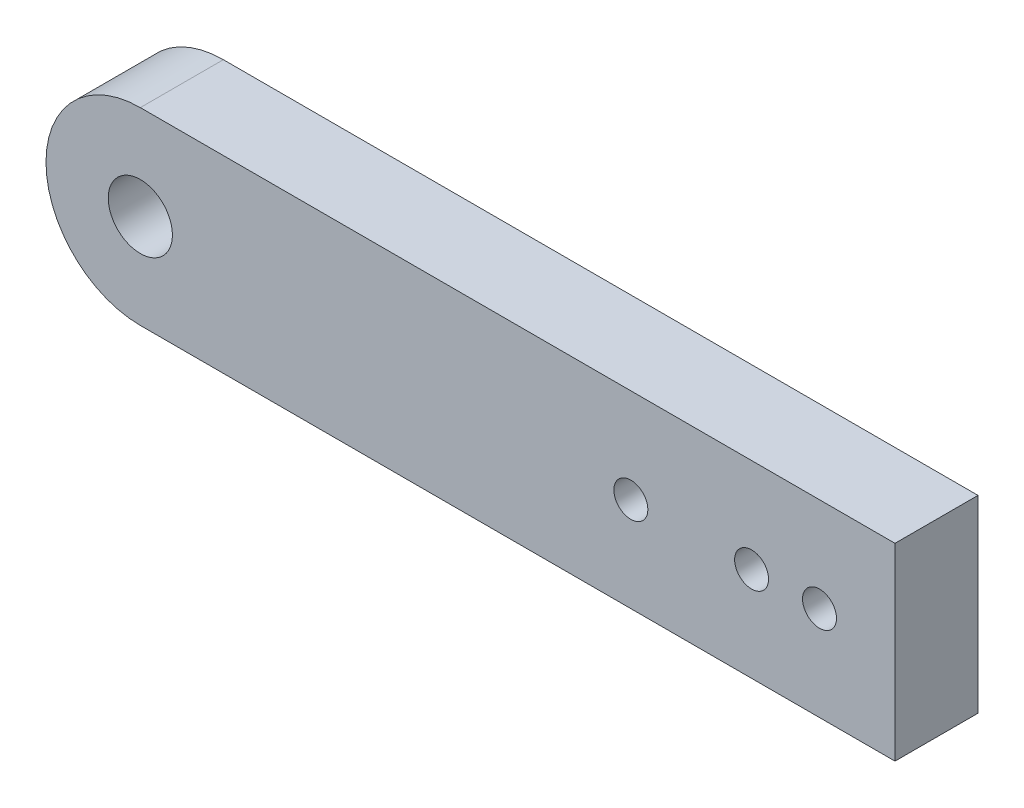
ISO-10303-21;
HEADER;
FILE_DESCRIPTION(('STEP AP214'),'2;1');
FILE_NAME('part.step','',(''),(''),'','','');
FILE_SCHEMA(('AUTOMOTIVE_DESIGN { 1 0 10303 214 1 1 1 1 }'));
ENDSEC;
DATA;
#1=APPLICATION_CONTEXT('core data for automotive mechanical design processes');
#2=APPLICATION_PROTOCOL_DEFINITION('international standard','automotive_design',2000,#1);
#3=PRODUCT_CONTEXT('',#1,'mechanical');
#4=PRODUCT('Part','Part','',(#3));
#5=PRODUCT_RELATED_PRODUCT_CATEGORY('part','',(#4));
#6=PRODUCT_DEFINITION_FORMATION('','',#4);
#7=PRODUCT_DEFINITION_CONTEXT('part definition',#1,'design');
#8=PRODUCT_DEFINITION('design','',#6,#7);
#9=PRODUCT_DEFINITION_SHAPE('','',#8);
#10=(LENGTH_UNIT() NAMED_UNIT(*) SI_UNIT(.MILLI.,.METRE.));
#11=(NAMED_UNIT(*) PLANE_ANGLE_UNIT() SI_UNIT($,.RADIAN.));
#12=(NAMED_UNIT(*) SI_UNIT($,.STERADIAN.) SOLID_ANGLE_UNIT());
#13=UNCERTAINTY_MEASURE_WITH_UNIT(LENGTH_MEASURE(1.E-05),#10,'distance_accuracy_value','');
#14=(GEOMETRIC_REPRESENTATION_CONTEXT(3) GLOBAL_UNCERTAINTY_ASSIGNED_CONTEXT((#13)) GLOBAL_UNIT_ASSIGNED_CONTEXT((#10,
#11,#12)) REPRESENTATION_CONTEXT('',''));
#15=CARTESIAN_POINT('',(0.,0.,0.));
#16=DIRECTION('',(0.,0.,1.));
#17=DIRECTION('',(1.,0.,0.));
#18=AXIS2_PLACEMENT_3D('',#15,#16,#17);
#19=CARTESIAN_POINT('',(-56.8282608698775,-2.53872853885262,11.));
#20=DIRECTION('',(0.,0.,1.));
#21=DIRECTION('',(1.,0.,0.));
#22=AXIS2_PLACEMENT_3D('',#19,#20,#21);
#23=PLANE('',#22);
#24=CARTESIAN_POINT('',(8.17173913012246,-2.53872853885262,11.));
#25=DIRECTION('',(0.,0.,1.));
#26=DIRECTION('',(1.,0.,0.));
#27=AXIS2_PLACEMENT_3D('',#24,#25,#26);
#28=CIRCLE('',#27,2.25);
#29=CARTESIAN_POINT('',(10.4217391301225,-2.53872853885262,11.));
#30=VERTEX_POINT('',#29);
#31=EDGE_CURVE('E122',#30,#30,#28,.T.);
#32=ORIENTED_EDGE('',*,*,#31,.F.);
#33=EDGE_LOOP('',(#32));
#34=FACE_BOUND('',#33,.T.);
#35=CARTESIAN_POINT('',(33.1717391301225,-2.53872853885262,11.));
#36=DIRECTION('',(0.,0.,1.));
#37=DIRECTION('',(1.,0.,0.));
#38=AXIS2_PLACEMENT_3D('',#35,#36,#37);
#39=CIRCLE('',#38,2.25);
#40=CARTESIAN_POINT('',(35.4217391301225,-2.53872853885262,11.));
#41=VERTEX_POINT('',#40);
#42=EDGE_CURVE('E101',#41,#41,#39,.T.);
#43=ORIENTED_EDGE('',*,*,#42,.F.);
#44=EDGE_LOOP('',(#43));
#45=FACE_BOUND('',#44,.T.);
#46=CARTESIAN_POINT('',(-56.8282608698775,-2.53872853885262,11.));
#47=DIRECTION('',(0.,0.,1.));
#48=DIRECTION('',(1.,0.,0.));
#49=AXIS2_PLACEMENT_3D('',#46,#47,#48);
#50=CIRCLE('',#49,12.5);
#51=CARTESIAN_POINT('',(-56.8282608698775,9.96127146114738,11.));
#52=VERTEX_POINT('',#51);
#53=CARTESIAN_POINT('',(-56.8282608698775,-15.0387285388526,11.));
#54=VERTEX_POINT('',#53);
#55=EDGE_CURVE('E86',#52,#54,#50,.T.);
#56=ORIENTED_EDGE('',*,*,#55,.T.);
#57=DIRECTION('',(1.,0.,0.));
#58=VECTOR('',#57,1.);
#59=CARTESIAN_POINT('',(-56.8282608698775,-15.0387285388526,11.));
#60=LINE('',#59,#58);
#61=CARTESIAN_POINT('',(43.1717391301225,-15.0387285388526,11.));
#62=VERTEX_POINT('',#61);
#63=EDGE_CURVE('E81',#54,#62,#60,.T.);
#64=ORIENTED_EDGE('',*,*,#63,.T.);
#65=DIRECTION('',(0.,1.,0.));
#66=VECTOR('',#65,1.);
#67=CARTESIAN_POINT('',(43.1717391301225,9.96127146114738,11.));
#68=LINE('',#67,#66);
#69=CARTESIAN_POINT('',(43.1717391301225,9.96127146114738,11.));
#70=VERTEX_POINT('',#69);
#71=EDGE_CURVE('E84',#62,#70,#68,.T.);
#72=ORIENTED_EDGE('',*,*,#71,.T.);
#73=DIRECTION('',(-1.,0.,0.));
#74=VECTOR('',#73,1.);
#75=CARTESIAN_POINT('',(-56.8282608698775,9.96127146114738,11.));
#76=LINE('',#75,#74);
#77=EDGE_CURVE('E51',#70,#52,#76,.T.);
#78=ORIENTED_EDGE('',*,*,#77,.T.);
#79=EDGE_LOOP('',(#56,#64,#72,#78));
#80=FACE_BOUND('',#79,.T.);
#81=CARTESIAN_POINT('',(24.1717391301225,-2.53872853885262,11.));
#82=DIRECTION('',(0.,0.,1.));
#83=DIRECTION('',(1.,0.,0.));
#84=AXIS2_PLACEMENT_3D('',#81,#82,#83);
#85=CIRCLE('',#84,2.25);
#86=CARTESIAN_POINT('',(26.4217391301225,-2.53872853885262,11.));
#87=VERTEX_POINT('',#86);
#88=EDGE_CURVE('E116',#87,#87,#85,.T.);
#89=ORIENTED_EDGE('',*,*,#88,.F.);
#90=EDGE_LOOP('',(#89));
#91=FACE_BOUND('',#90,.T.);
#92=CARTESIAN_POINT('',(-56.8282608698775,-2.53872853885262,11.));
#93=DIRECTION('',(0.,0.,1.));
#94=DIRECTION('',(1.,0.,0.));
#95=AXIS2_PLACEMENT_3D('',#92,#93,#94);
#96=CIRCLE('',#95,4.25000000000001);
#97=CARTESIAN_POINT('',(-52.5782608698775,-2.53872853885262,11.));
#98=VERTEX_POINT('',#97);
#99=EDGE_CURVE('E128',#98,#98,#96,.T.);
#100=ORIENTED_EDGE('',*,*,#99,.F.);
#101=EDGE_LOOP('',(#100));
#102=FACE_BOUND('',#101,.T.);
#103=ADVANCED_FACE('F34',(#34,#45,#80,#91,#102),#23,.T.);
#104=CARTESIAN_POINT('',(-56.8282608698775,-2.53872853885262,0.));
#105=DIRECTION('',(0.,0.,1.));
#106=DIRECTION('',(1.,0.,0.));
#107=AXIS2_PLACEMENT_3D('',#104,#105,#106);
#108=PLANE('',#107);
#109=CARTESIAN_POINT('',(-56.8282608698775,-2.53872853885262,0.));
#110=DIRECTION('',(0.,0.,1.));
#111=DIRECTION('',(1.,0.,0.));
#112=AXIS2_PLACEMENT_3D('',#109,#110,#111);
#113=CIRCLE('',#112,12.5);
#114=CARTESIAN_POINT('',(-56.8282608698775,9.96127146114738,0.));
#115=VERTEX_POINT('',#114);
#116=CARTESIAN_POINT('',(-56.8282608698775,-15.0387285388526,0.));
#117=VERTEX_POINT('',#116);
#118=EDGE_CURVE('E98',#115,#117,#113,.T.);
#119=ORIENTED_EDGE('',*,*,#118,.F.);
#120=DIRECTION('',(-1.,0.,0.));
#121=VECTOR('',#120,1.);
#122=CARTESIAN_POINT('',(-56.8282608698775,9.96127146114738,0.));
#123=LINE('',#122,#121);
#124=CARTESIAN_POINT('',(43.1717391301225,9.96127146114738,0.));
#125=VERTEX_POINT('',#124);
#126=EDGE_CURVE('E74',#125,#115,#123,.T.);
#127=ORIENTED_EDGE('',*,*,#126,.F.);
#128=DIRECTION('',(0.,1.,0.));
#129=VECTOR('',#128,1.);
#130=CARTESIAN_POINT('',(43.1717391301225,9.96127146114738,0.));
#131=LINE('',#130,#129);
#132=CARTESIAN_POINT('',(43.1717391301225,-15.0387285388526,0.));
#133=VERTEX_POINT('',#132);
#134=EDGE_CURVE('E68',#133,#125,#131,.T.);
#135=ORIENTED_EDGE('',*,*,#134,.F.);
#136=DIRECTION('',(1.,0.,0.));
#137=VECTOR('',#136,1.);
#138=CARTESIAN_POINT('',(-56.8282608698775,-15.0387285388526,0.));
#139=LINE('',#138,#137);
#140=EDGE_CURVE('E90',#117,#133,#139,.T.);
#141=ORIENTED_EDGE('',*,*,#140,.F.);
#142=EDGE_LOOP('',(#119,#127,#135,#141));
#143=FACE_BOUND('',#142,.T.);
#144=CARTESIAN_POINT('',(33.1717391301225,-2.53872853885262,0.));
#145=DIRECTION('',(0.,0.,1.));
#146=DIRECTION('',(1.,0.,0.));
#147=AXIS2_PLACEMENT_3D('',#144,#145,#146);
#148=CIRCLE('',#147,2.25);
#149=CARTESIAN_POINT('',(35.4217391301225,-2.53872853885262,0.));
#150=VERTEX_POINT('',#149);
#151=EDGE_CURVE('E113',#150,#150,#148,.T.);
#152=ORIENTED_EDGE('',*,*,#151,.T.);
#153=EDGE_LOOP('',(#152));
#154=FACE_BOUND('',#153,.T.);
#155=CARTESIAN_POINT('',(24.1717391301225,-2.53872853885262,0.));
#156=DIRECTION('',(0.,0.,1.));
#157=DIRECTION('',(1.,0.,0.));
#158=AXIS2_PLACEMENT_3D('',#155,#156,#157);
#159=CIRCLE('',#158,2.25);
#160=CARTESIAN_POINT('',(26.4217391301225,-2.53872853885262,0.));
#161=VERTEX_POINT('',#160);
#162=EDGE_CURVE('E119',#161,#161,#159,.T.);
#163=ORIENTED_EDGE('',*,*,#162,.T.);
#164=EDGE_LOOP('',(#163));
#165=FACE_BOUND('',#164,.T.);
#166=CARTESIAN_POINT('',(8.17173913012246,-2.53872853885262,0.));
#167=DIRECTION('',(0.,0.,1.));
#168=DIRECTION('',(1.,0.,0.));
#169=AXIS2_PLACEMENT_3D('',#166,#167,#168);
#170=CIRCLE('',#169,2.25);
#171=CARTESIAN_POINT('',(10.4217391301225,-2.53872853885262,0.));
#172=VERTEX_POINT('',#171);
#173=EDGE_CURVE('E125',#172,#172,#170,.T.);
#174=ORIENTED_EDGE('',*,*,#173,.T.);
#175=EDGE_LOOP('',(#174));
#176=FACE_BOUND('',#175,.T.);
#177=CARTESIAN_POINT('',(-56.8282608698775,-2.53872853885262,0.));
#178=DIRECTION('',(0.,0.,1.));
#179=DIRECTION('',(1.,0.,0.));
#180=AXIS2_PLACEMENT_3D('',#177,#178,#179);
#181=CIRCLE('',#180,4.25000000000001);
#182=CARTESIAN_POINT('',(-52.5782608698775,-2.53872853885262,0.));
#183=VERTEX_POINT('',#182);
#184=EDGE_CURVE('E131',#183,#183,#181,.T.);
#185=ORIENTED_EDGE('',*,*,#184,.T.);
#186=EDGE_LOOP('',(#185));
#187=FACE_BOUND('',#186,.T.);
#188=ADVANCED_FACE('F109',(#143,#154,#165,#176,#187),#108,.F.);
#189=CARTESIAN_POINT('',(-56.8282608698775,-2.53872853885262,11.));
#190=DIRECTION('',(0.,0.,-1.));
#191=DIRECTION('',(-1.,0.,0.));
#192=AXIS2_PLACEMENT_3D('',#189,#190,#191);
#193=CYLINDRICAL_SURFACE('',#192,12.5);
#194=ORIENTED_EDGE('',*,*,#118,.T.);
#195=DIRECTION('',(0.,0.,-1.));
#196=VECTOR('',#195,1.);
#197=CARTESIAN_POINT('',(-56.8282608698775,-15.0387285388526,11.));
#198=LINE('',#197,#196);
#199=EDGE_CURVE('E11',#54,#117,#198,.T.);
#200=ORIENTED_EDGE('',*,*,#199,.F.);
#201=ORIENTED_EDGE('',*,*,#55,.F.);
#202=DIRECTION('',(0.,0.,-1.));
#203=VECTOR('',#202,1.);
#204=CARTESIAN_POINT('',(-56.8282608698775,9.96127146114738,11.));
#205=LINE('',#204,#203);
#206=EDGE_CURVE('E94',#52,#115,#205,.T.);
#207=ORIENTED_EDGE('',*,*,#206,.T.);
#208=EDGE_LOOP('',(#194,#200,#201,#207));
#209=FACE_BOUND('',#208,.T.);
#210=ADVANCED_FACE('F36',(#209),#193,.T.);
#211=CARTESIAN_POINT('',(-56.8282608698775,-15.0387285388526,11.));
#212=DIRECTION('',(0.,1.,0.));
#213=DIRECTION('',(0.,0.,1.));
#214=AXIS2_PLACEMENT_3D('',#211,#212,#213);
#215=PLANE('',#214);
#216=ORIENTED_EDGE('',*,*,#140,.T.);
#217=DIRECTION('',(0.,0.,-1.));
#218=VECTOR('',#217,1.);
#219=CARTESIAN_POINT('',(43.1717391301225,-15.0387285388526,11.));
#220=LINE('',#219,#218);
#221=EDGE_CURVE('E43',#62,#133,#220,.T.);
#222=ORIENTED_EDGE('',*,*,#221,.F.);
#223=ORIENTED_EDGE('',*,*,#63,.F.);
#224=ORIENTED_EDGE('',*,*,#199,.T.);
#225=EDGE_LOOP('',(#216,#222,#223,#224));
#226=FACE_BOUND('',#225,.T.);
#227=ADVANCED_FACE('F89',(#226),#215,.F.);
#228=CARTESIAN_POINT('',(43.1717391301225,9.96127146114738,11.));
#229=DIRECTION('',(-1.,0.,0.));
#230=DIRECTION('',(0.,-1.,0.));
#231=AXIS2_PLACEMENT_3D('',#228,#229,#230);
#232=PLANE('',#231);
#233=ORIENTED_EDGE('',*,*,#134,.T.);
#234=DIRECTION('',(0.,0.,-1.));
#235=VECTOR('',#234,1.);
#236=CARTESIAN_POINT('',(43.1717391301225,9.96127146114738,11.));
#237=LINE('',#236,#235);
#238=EDGE_CURVE('E91',#70,#125,#237,.T.);
#239=ORIENTED_EDGE('',*,*,#238,.F.);
#240=ORIENTED_EDGE('',*,*,#71,.F.);
#241=ORIENTED_EDGE('',*,*,#221,.T.);
#242=EDGE_LOOP('',(#233,#239,#240,#241));
#243=FACE_BOUND('',#242,.T.);
#244=ADVANCED_FACE('F92',(#243),#232,.F.);
#245=CARTESIAN_POINT('',(-56.8282608698775,9.96127146114738,11.));
#246=DIRECTION('',(0.,-1.,0.));
#247=DIRECTION('',(1.,0.,0.));
#248=AXIS2_PLACEMENT_3D('',#245,#246,#247);
#249=PLANE('',#248);
#250=ORIENTED_EDGE('',*,*,#126,.T.);
#251=ORIENTED_EDGE('',*,*,#206,.F.);
#252=ORIENTED_EDGE('',*,*,#77,.F.);
#253=ORIENTED_EDGE('',*,*,#238,.T.);
#254=EDGE_LOOP('',(#250,#251,#252,#253));
#255=FACE_BOUND('',#254,.T.);
#256=ADVANCED_FACE('F106',(#255),#249,.F.);
#257=CARTESIAN_POINT('',(33.1717391301225,-2.53872853885262,11.));
#258=DIRECTION('',(0.,0.,-1.));
#259=DIRECTION('',(-1.,0.,0.));
#260=AXIS2_PLACEMENT_3D('',#257,#258,#259);
#261=CYLINDRICAL_SURFACE('',#260,2.25);
#262=ORIENTED_EDGE('',*,*,#42,.T.);
#263=EDGE_LOOP('',(#262));
#264=FACE_BOUND('',#263,.T.);
#265=ORIENTED_EDGE('',*,*,#151,.F.);
#266=EDGE_LOOP('',(#265));
#267=FACE_BOUND('',#266,.T.);
#268=ADVANCED_FACE('F150',(#264,#267),#261,.F.);
#269=CARTESIAN_POINT('',(24.1717391301225,-2.53872853885262,11.));
#270=DIRECTION('',(0.,0.,-1.));
#271=DIRECTION('',(-1.,0.,0.));
#272=AXIS2_PLACEMENT_3D('',#269,#270,#271);
#273=CYLINDRICAL_SURFACE('',#272,2.25);
#274=ORIENTED_EDGE('',*,*,#88,.T.);
#275=EDGE_LOOP('',(#274));
#276=FACE_BOUND('',#275,.T.);
#277=ORIENTED_EDGE('',*,*,#162,.F.);
#278=EDGE_LOOP('',(#277));
#279=FACE_BOUND('',#278,.T.);
#280=ADVANCED_FACE('F196',(#276,#279),#273,.F.);
#281=CARTESIAN_POINT('',(8.17173913012246,-2.53872853885262,11.));
#282=DIRECTION('',(0.,0.,-1.));
#283=DIRECTION('',(-1.,0.,0.));
#284=AXIS2_PLACEMENT_3D('',#281,#282,#283);
#285=CYLINDRICAL_SURFACE('',#284,2.25);
#286=ORIENTED_EDGE('',*,*,#31,.T.);
#287=EDGE_LOOP('',(#286));
#288=FACE_BOUND('',#287,.T.);
#289=ORIENTED_EDGE('',*,*,#173,.F.);
#290=EDGE_LOOP('',(#289));
#291=FACE_BOUND('',#290,.T.);
#292=ADVANCED_FACE('F204',(#288,#291),#285,.F.);
#293=CARTESIAN_POINT('',(-56.8282608698775,-2.53872853885262,11.));
#294=DIRECTION('',(0.,0.,-1.));
#295=DIRECTION('',(-1.,0.,0.));
#296=AXIS2_PLACEMENT_3D('',#293,#294,#295);
#297=CYLINDRICAL_SURFACE('',#296,4.25000000000001);
#298=ORIENTED_EDGE('',*,*,#99,.T.);
#299=EDGE_LOOP('',(#298));
#300=FACE_BOUND('',#299,.T.);
#301=ORIENTED_EDGE('',*,*,#184,.F.);
#302=EDGE_LOOP('',(#301));
#303=FACE_BOUND('',#302,.T.);
#304=ADVANCED_FACE('F137',(#300,#303),#297,.F.);
#305=CLOSED_SHELL('',(#103,#188,#210,#227,#244,#256,#268,#280,#292,#304));
#306=MANIFOLD_SOLID_BREP('B2',#305);
#307=ADVANCED_BREP_SHAPE_REPRESENTATION('',(#18,#306),#14);
#308=SHAPE_DEFINITION_REPRESENTATION(#9,#307);
ENDSEC;
END-ISO-10303-21;
